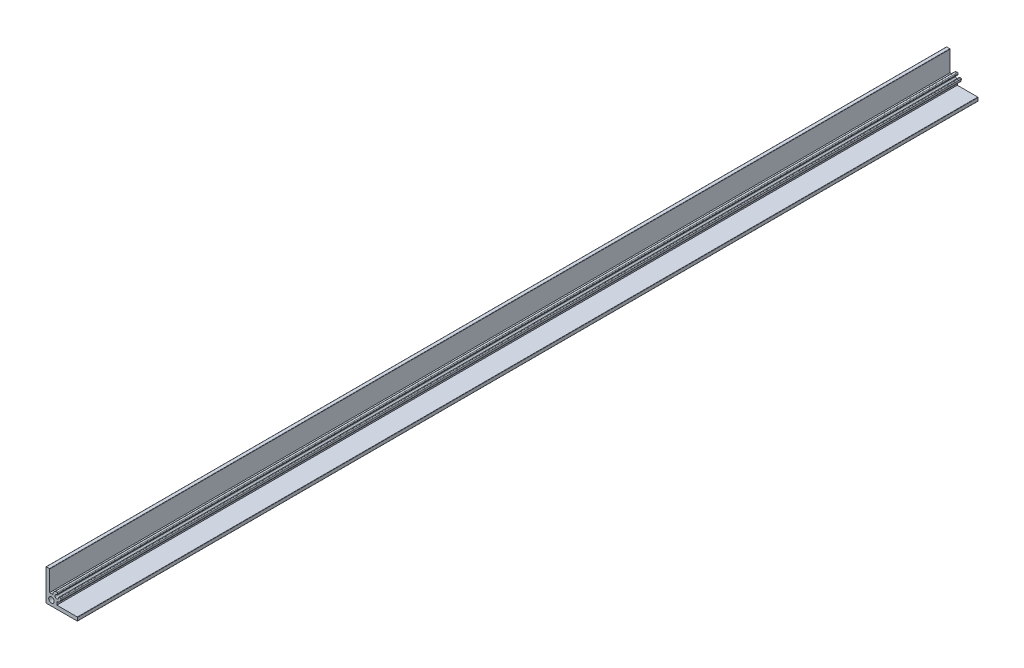
ISO-10303-21;
HEADER;
FILE_DESCRIPTION(('STEP AP214'),'2;1');
FILE_NAME('part.step','',(''),(''),'','','');
FILE_SCHEMA(('AUTOMOTIVE_DESIGN { 1 0 10303 214 1 1 1 1 }'));
ENDSEC;
DATA;
#1=APPLICATION_CONTEXT('core data for automotive mechanical design processes');
#2=APPLICATION_PROTOCOL_DEFINITION('international standard','automotive_design',2000,#1);
#3=PRODUCT_CONTEXT('',#1,'mechanical');
#4=PRODUCT('Part','Part','',(#3));
#5=PRODUCT_RELATED_PRODUCT_CATEGORY('part','',(#4));
#6=PRODUCT_DEFINITION_FORMATION('','',#4);
#7=PRODUCT_DEFINITION_CONTEXT('part definition',#1,'design');
#8=PRODUCT_DEFINITION('design','',#6,#7);
#9=PRODUCT_DEFINITION_SHAPE('','',#8);
#10=(LENGTH_UNIT() NAMED_UNIT(*) SI_UNIT(.MILLI.,.METRE.));
#11=(NAMED_UNIT(*) PLANE_ANGLE_UNIT() SI_UNIT($,.RADIAN.));
#12=(NAMED_UNIT(*) SI_UNIT($,.STERADIAN.) SOLID_ANGLE_UNIT());
#13=UNCERTAINTY_MEASURE_WITH_UNIT(LENGTH_MEASURE(1.E-05),#10,'distance_accuracy_value','');
#14=(GEOMETRIC_REPRESENTATION_CONTEXT(3) GLOBAL_UNCERTAINTY_ASSIGNED_CONTEXT((#13)) GLOBAL_UNIT_ASSIGNED_CONTEXT((#10,
#11,#12)) REPRESENTATION_CONTEXT('',''));
#15=CARTESIAN_POINT('',(0.,0.,0.));
#16=DIRECTION('',(0.,0.,1.));
#17=DIRECTION('',(1.,0.,0.));
#18=AXIS2_PLACEMENT_3D('',#15,#16,#17);
#19=CARTESIAN_POINT('',(11.9999999999999,12.,1000.));
#20=DIRECTION('',(0.,0.,1.));
#21=DIRECTION('',(1.,0.,0.));
#22=AXIS2_PLACEMENT_3D('',#19,#20,#21);
#23=PLANE('',#22);
#24=CARTESIAN_POINT('',(11.9999999999999,12.,1000.));
#25=DIRECTION('',(0.,0.,1.));
#26=DIRECTION('',(1.,0.,0.));
#27=AXIS2_PLACEMENT_3D('',#24,#25,#26);
#28=CIRCLE('',#27,4.50000000000001);
#29=CARTESIAN_POINT('',(12.,7.50000000000001,1000.));
#30=VERTEX_POINT('',#29);
#31=CARTESIAN_POINT('',(16.4879412286593,12.329216536795,1000.));
#32=VERTEX_POINT('',#31);
#33=EDGE_CURVE('E209',#30,#32,#28,.T.);
#34=ORIENTED_EDGE('',*,*,#33,.T.);
#35=CARTESIAN_POINT('',(15.7399510238828,12.2743471139958,1000.));
#36=DIRECTION('',(0.,0.,1.));
#37=DIRECTION('',(1.,0.,0.));
#38=AXIS2_PLACEMENT_3D('',#35,#36,#37);
#39=CIRCLE('',#38,0.75);
#40=CARTESIAN_POINT('',(15.5365921475919,12.996250963157,1000.));
#41=VERTEX_POINT('',#40);
#42=EDGE_CURVE('E328',#32,#41,#39,.T.);
#43=ORIENTED_EDGE('',*,*,#42,.T.);
#44=DIRECTION('',(-0.962538465548211,-0.271145168387887,0.));
#45=VECTOR('',#44,1.);
#46=CARTESIAN_POINT('',(16.3314230949669,13.2201532577455,1000.));
#47=LINE('',#46,#45);
#48=CARTESIAN_POINT('',(14.1949254082614,12.6183061152604,1000.));
#49=VERTEX_POINT('',#48);
#50=EDGE_CURVE('E211',#41,#49,#47,.T.);
#51=ORIENTED_EDGE('',*,*,#50,.T.);
#52=CARTESIAN_POINT('',(14.2762689587777,12.329544575596,1000.));
#53=DIRECTION('',(0.,0.,1.));
#54=DIRECTION('',(1.,0.,0.));
#55=AXIS2_PLACEMENT_3D('',#52,#53,#54);
#56=CIRCLE('',#55,0.3);
#57=CARTESIAN_POINT('',(13.9793643119806,12.2865605005182,1000.));
#58=VERTEX_POINT('',#57);
#59=EDGE_CURVE('E288',#49,#58,#56,.T.);
#60=ORIENTED_EDGE('',*,*,#59,.T.);
#61=CARTESIAN_POINT('',(11.9999999999999,12.,1000.));
#62=DIRECTION('',(0.,0.,-1.));
#63=DIRECTION('',(1.,0.,0.));
#64=AXIS2_PLACEMENT_3D('',#61,#62,#63);
#65=CIRCLE('',#64,2.);
#66=CARTESIAN_POINT('',(12.2865605005182,13.9793643119807,1000.));
#67=VERTEX_POINT('',#66);
#68=EDGE_CURVE('E247',#58,#67,#65,.T.);
#69=ORIENTED_EDGE('',*,*,#68,.T.);
#70=CARTESIAN_POINT('',(12.329544575596,14.2762689587778,1000.));
#71=DIRECTION('',(0.,0.,1.));
#72=DIRECTION('',(1.,0.,0.));
#73=AXIS2_PLACEMENT_3D('',#70,#71,#72);
#74=CIRCLE('',#73,0.3);
#75=CARTESIAN_POINT('',(12.6183061152605,14.1949254082614,1000.));
#76=VERTEX_POINT('',#75);
#77=EDGE_CURVE('E286',#67,#76,#74,.T.);
#78=ORIENTED_EDGE('',*,*,#77,.T.);
#79=DIRECTION('',(0.271145168387888,0.962538465548211,0.));
#80=VECTOR('',#79,1.);
#81=CARTESIAN_POINT('',(12.5422903367757,13.9250769310964,1000.));
#82=LINE('',#81,#80);
#83=CARTESIAN_POINT('',(12.996250963157,15.5365921475919,1000.));
#84=VERTEX_POINT('',#83);
#85=EDGE_CURVE('E173',#76,#84,#82,.T.);
#86=ORIENTED_EDGE('',*,*,#85,.T.);
#87=CARTESIAN_POINT('',(12.2743471139958,15.7399510238828,1000.));
#88=DIRECTION('',(0.,0.,1.));
#89=DIRECTION('',(1.,0.,0.));
#90=AXIS2_PLACEMENT_3D('',#87,#88,#89);
#91=CIRCLE('',#90,0.75);
#92=CARTESIAN_POINT('',(12.329216536795,16.4879412286593,1000.));
#93=VERTEX_POINT('',#92);
#94=EDGE_CURVE('E31',#84,#93,#91,.T.);
#95=ORIENTED_EDGE('',*,*,#94,.T.);
#96=CARTESIAN_POINT('',(11.9999999999999,12.,1000.));
#97=DIRECTION('',(0.,0.,1.));
#98=DIRECTION('',(1.,0.,0.));
#99=AXIS2_PLACEMENT_3D('',#96,#97,#98);
#100=CIRCLE('',#99,4.49999999999995);
#101=CARTESIAN_POINT('',(7.49999999999999,12.,1000.));
#102=VERTEX_POINT('',#101);
#103=EDGE_CURVE('E162',#93,#102,#100,.T.);
#104=ORIENTED_EDGE('',*,*,#103,.T.);
#105=DIRECTION('',(-1.,0.,0.));
#106=VECTOR('',#105,1.);
#107=CARTESIAN_POINT('',(7.50000000000001,12.,1000.));
#108=LINE('',#107,#106);
#109=CARTESIAN_POINT('',(4.,12.,1000.));
#110=VERTEX_POINT('',#109);
#111=EDGE_CURVE('E168',#102,#110,#108,.T.);
#112=ORIENTED_EDGE('',*,*,#111,.T.);
#113=DIRECTION('',(0.,1.,0.));
#114=VECTOR('',#113,1.);
#115=CARTESIAN_POINT('',(4.,12.,1000.));
#116=LINE('',#115,#114);
#117=CARTESIAN_POINT('',(4.,34.7,1000.));
#118=VERTEX_POINT('',#117);
#119=EDGE_CURVE('E188',#110,#118,#116,.T.);
#120=ORIENTED_EDGE('',*,*,#119,.T.);
#121=CARTESIAN_POINT('',(3.7,34.7,1000.));
#122=DIRECTION('',(0.,0.,1.));
#123=DIRECTION('',(1.,0.,0.));
#124=AXIS2_PLACEMENT_3D('',#121,#122,#123);
#125=CIRCLE('',#124,0.3);
#126=CARTESIAN_POINT('',(3.7,35.,1000.));
#127=VERTEX_POINT('',#126);
#128=EDGE_CURVE('E282',#118,#127,#125,.T.);
#129=ORIENTED_EDGE('',*,*,#128,.T.);
#130=DIRECTION('',(-1.,0.,0.));
#131=VECTOR('',#130,1.);
#132=CARTESIAN_POINT('',(4.,35.,1000.));
#133=LINE('',#132,#131);
#134=CARTESIAN_POINT('',(0.3,35.,1000.));
#135=VERTEX_POINT('',#134);
#136=EDGE_CURVE('E190',#127,#135,#133,.T.);
#137=ORIENTED_EDGE('',*,*,#136,.T.);
#138=CARTESIAN_POINT('',(0.3,34.7,1000.));
#139=DIRECTION('',(0.,0.,1.));
#140=DIRECTION('',(1.,0.,0.));
#141=AXIS2_PLACEMENT_3D('',#138,#139,#140);
#142=CIRCLE('',#141,0.3);
#143=CARTESIAN_POINT('',(0.,34.7,1000.));
#144=VERTEX_POINT('',#143);
#145=EDGE_CURVE('E284',#135,#144,#142,.T.);
#146=ORIENTED_EDGE('',*,*,#145,.T.);
#147=DIRECTION('',(0.,-1.,0.));
#148=VECTOR('',#147,1.);
#149=CARTESIAN_POINT('',(0.,35.,1000.));
#150=LINE('',#149,#148);
#151=CARTESIAN_POINT('',(0.,0.300000000000002,1000.));
#152=VERTEX_POINT('',#151);
#153=EDGE_CURVE('E196',#144,#152,#150,.T.);
#154=ORIENTED_EDGE('',*,*,#153,.T.);
#155=CARTESIAN_POINT('',(0.3,0.3,1000.));
#156=DIRECTION('',(0.,0.,1.));
#157=DIRECTION('',(1.,0.,0.));
#158=AXIS2_PLACEMENT_3D('',#155,#156,#157);
#159=CIRCLE('',#158,0.3);
#160=CARTESIAN_POINT('',(0.3,0.,1000.));
#161=VERTEX_POINT('',#160);
#162=EDGE_CURVE('E276',#152,#161,#159,.T.);
#163=ORIENTED_EDGE('',*,*,#162,.T.);
#164=DIRECTION('',(1.,0.,0.));
#165=VECTOR('',#164,1.);
#166=CARTESIAN_POINT('',(0.,0.,1000.));
#167=LINE('',#166,#165);
#168=CARTESIAN_POINT('',(34.7,0.,1000.));
#169=VERTEX_POINT('',#168);
#170=EDGE_CURVE('E199',#161,#169,#167,.T.);
#171=ORIENTED_EDGE('',*,*,#170,.T.);
#172=CARTESIAN_POINT('',(34.7,0.3,1000.));
#173=DIRECTION('',(0.,0.,1.));
#174=DIRECTION('',(1.,0.,0.));
#175=AXIS2_PLACEMENT_3D('',#172,#173,#174);
#176=CIRCLE('',#175,0.3);
#177=CARTESIAN_POINT('',(35.,0.3,1000.));
#178=VERTEX_POINT('',#177);
#179=EDGE_CURVE('E278',#169,#178,#176,.T.);
#180=ORIENTED_EDGE('',*,*,#179,.T.);
#181=DIRECTION('',(0.,1.,0.));
#182=VECTOR('',#181,1.);
#183=CARTESIAN_POINT('',(35.,0.,1000.));
#184=LINE('',#183,#182);
#185=CARTESIAN_POINT('',(35.,3.7,1000.));
#186=VERTEX_POINT('',#185);
#187=EDGE_CURVE('E202',#178,#186,#184,.T.);
#188=ORIENTED_EDGE('',*,*,#187,.T.);
#189=CARTESIAN_POINT('',(34.7,3.7,1000.));
#190=DIRECTION('',(0.,0.,1.));
#191=DIRECTION('',(1.,0.,0.));
#192=AXIS2_PLACEMENT_3D('',#189,#190,#191);
#193=CIRCLE('',#192,0.3);
#194=CARTESIAN_POINT('',(34.7,4.,1000.));
#195=VERTEX_POINT('',#194);
#196=EDGE_CURVE('E280',#186,#195,#193,.T.);
#197=ORIENTED_EDGE('',*,*,#196,.T.);
#198=DIRECTION('',(-1.,0.,0.));
#199=VECTOR('',#198,1.);
#200=CARTESIAN_POINT('',(35.,4.,1000.));
#201=LINE('',#200,#199);
#202=CARTESIAN_POINT('',(12.,4.,1000.));
#203=VERTEX_POINT('',#202);
#204=EDGE_CURVE('E205',#195,#203,#201,.T.);
#205=ORIENTED_EDGE('',*,*,#204,.T.);
#206=DIRECTION('',(0.,1.,0.));
#207=VECTOR('',#206,1.);
#208=CARTESIAN_POINT('',(12.,4.,1000.));
#209=LINE('',#208,#207);
#210=EDGE_CURVE('E207',#203,#30,#209,.T.);
#211=ORIENTED_EDGE('',*,*,#210,.T.);
#212=EDGE_LOOP('',(#34,#43,#51,#60,#69,#78,#86,#95,#104,#112,#120,#129,#137,#146,#154,#163,#171,
#180,#188,#197,#205,#211));
#213=FACE_BOUND('',#212,.T.);
#214=CARTESIAN_POINT('',(5.99999999999994,5.99999999999997,1000.));
#215=DIRECTION('',(0.,0.,1.));
#216=DIRECTION('',(1.,0.,0.));
#217=AXIS2_PLACEMENT_3D('',#214,#215,#216);
#218=CIRCLE('',#217,3.);
#219=CARTESIAN_POINT('',(8.99999999999994,5.99999999999997,1000.));
#220=VERTEX_POINT('',#219);
#221=EDGE_CURVE('E218',#220,#220,#218,.T.);
#222=ORIENTED_EDGE('',*,*,#221,.F.);
#223=EDGE_LOOP('',(#222));
#224=FACE_BOUND('',#223,.T.);
#225=ADVANCED_FACE('F16',(#213,#224),#23,.T.);
#226=CARTESIAN_POINT('',(11.9999999999999,12.,0.));
#227=DIRECTION('',(0.,0.,1.));
#228=DIRECTION('',(1.,0.,0.));
#229=AXIS2_PLACEMENT_3D('',#226,#227,#228);
#230=PLANE('',#229);
#231=DIRECTION('',(-0.962538465548211,-0.271145168387887,0.));
#232=VECTOR('',#231,1.);
#233=CARTESIAN_POINT('',(16.3314230949669,13.2201532577455,0.));
#234=LINE('',#233,#232);
#235=CARTESIAN_POINT('',(15.5365921475919,12.996250963157,0.));
#236=VERTEX_POINT('',#235);
#237=CARTESIAN_POINT('',(14.1949254082614,12.6183061152604,0.));
#238=VERTEX_POINT('',#237);
#239=EDGE_CURVE('E245',#236,#238,#234,.T.);
#240=ORIENTED_EDGE('',*,*,#239,.F.);
#241=CARTESIAN_POINT('',(15.7399510238828,12.2743471139958,0.));
#242=DIRECTION('',(0.,0.,1.));
#243=DIRECTION('',(1.,0.,0.));
#244=AXIS2_PLACEMENT_3D('',#241,#242,#243);
#245=CIRCLE('',#244,0.75);
#246=CARTESIAN_POINT('',(16.4879412286593,12.329216536795,0.));
#247=VERTEX_POINT('',#246);
#248=EDGE_CURVE('E323',#236,#247,#245,.F.);
#249=ORIENTED_EDGE('',*,*,#248,.T.);
#250=CARTESIAN_POINT('',(11.9999999999999,12.,0.));
#251=DIRECTION('',(0.,0.,1.));
#252=DIRECTION('',(1.,0.,0.));
#253=AXIS2_PLACEMENT_3D('',#250,#251,#252);
#254=CIRCLE('',#253,4.50000000000001);
#255=CARTESIAN_POINT('',(12.,7.50000000000001,0.));
#256=VERTEX_POINT('',#255);
#257=EDGE_CURVE('E242',#256,#247,#254,.T.);
#258=ORIENTED_EDGE('',*,*,#257,.F.);
#259=DIRECTION('',(0.,1.,0.));
#260=VECTOR('',#259,1.);
#261=CARTESIAN_POINT('',(12.,4.,0.));
#262=LINE('',#261,#260);
#263=CARTESIAN_POINT('',(12.,4.,0.));
#264=VERTEX_POINT('',#263);
#265=EDGE_CURVE('E240',#264,#256,#262,.T.);
#266=ORIENTED_EDGE('',*,*,#265,.F.);
#267=DIRECTION('',(-1.,0.,0.));
#268=VECTOR('',#267,1.);
#269=CARTESIAN_POINT('',(35.,4.,0.));
#270=LINE('',#269,#268);
#271=CARTESIAN_POINT('',(34.7,4.,0.));
#272=VERTEX_POINT('',#271);
#273=EDGE_CURVE('E238',#272,#264,#270,.T.);
#274=ORIENTED_EDGE('',*,*,#273,.F.);
#275=CARTESIAN_POINT('',(34.7,3.7,0.));
#276=DIRECTION('',(0.,0.,1.));
#277=DIRECTION('',(1.,0.,0.));
#278=AXIS2_PLACEMENT_3D('',#275,#276,#277);
#279=CIRCLE('',#278,0.3);
#280=CARTESIAN_POINT('',(35.,3.7,0.));
#281=VERTEX_POINT('',#280);
#282=EDGE_CURVE('E262',#272,#281,#279,.F.);
#283=ORIENTED_EDGE('',*,*,#282,.T.);
#284=DIRECTION('',(0.,1.,0.));
#285=VECTOR('',#284,1.);
#286=CARTESIAN_POINT('',(35.,0.,0.));
#287=LINE('',#286,#285);
#288=CARTESIAN_POINT('',(35.,0.3,0.));
#289=VERTEX_POINT('',#288);
#290=EDGE_CURVE('E235',#289,#281,#287,.T.);
#291=ORIENTED_EDGE('',*,*,#290,.F.);
#292=CARTESIAN_POINT('',(34.7,0.3,0.));
#293=DIRECTION('',(0.,0.,1.));
#294=DIRECTION('',(1.,0.,0.));
#295=AXIS2_PLACEMENT_3D('',#292,#293,#294);
#296=CIRCLE('',#295,0.3);
#297=CARTESIAN_POINT('',(34.7,0.,0.));
#298=VERTEX_POINT('',#297);
#299=EDGE_CURVE('E260',#289,#298,#296,.F.);
#300=ORIENTED_EDGE('',*,*,#299,.T.);
#301=DIRECTION('',(1.,0.,0.));
#302=VECTOR('',#301,1.);
#303=CARTESIAN_POINT('',(0.,0.,0.));
#304=LINE('',#303,#302);
#305=CARTESIAN_POINT('',(0.3,0.,0.));
#306=VERTEX_POINT('',#305);
#307=EDGE_CURVE('E232',#306,#298,#304,.T.);
#308=ORIENTED_EDGE('',*,*,#307,.F.);
#309=CARTESIAN_POINT('',(0.3,0.3,0.));
#310=DIRECTION('',(0.,0.,1.));
#311=DIRECTION('',(1.,0.,0.));
#312=AXIS2_PLACEMENT_3D('',#309,#310,#311);
#313=CIRCLE('',#312,0.3);
#314=CARTESIAN_POINT('',(0.,0.300000000000002,0.));
#315=VERTEX_POINT('',#314);
#316=EDGE_CURVE('E258',#306,#315,#313,.F.);
#317=ORIENTED_EDGE('',*,*,#316,.T.);
#318=DIRECTION('',(0.,-1.,0.));
#319=VECTOR('',#318,1.);
#320=CARTESIAN_POINT('',(0.,35.,0.));
#321=LINE('',#320,#319);
#322=CARTESIAN_POINT('',(0.,34.7,0.));
#323=VERTEX_POINT('',#322);
#324=EDGE_CURVE('E229',#323,#315,#321,.T.);
#325=ORIENTED_EDGE('',*,*,#324,.F.);
#326=CARTESIAN_POINT('',(0.3,34.7,0.));
#327=DIRECTION('',(0.,0.,1.));
#328=DIRECTION('',(1.,0.,0.));
#329=AXIS2_PLACEMENT_3D('',#326,#327,#328);
#330=CIRCLE('',#329,0.3);
#331=CARTESIAN_POINT('',(0.3,35.,0.));
#332=VERTEX_POINT('',#331);
#333=EDGE_CURVE('E266',#323,#332,#330,.F.);
#334=ORIENTED_EDGE('',*,*,#333,.T.);
#335=DIRECTION('',(-1.,0.,0.));
#336=VECTOR('',#335,1.);
#337=CARTESIAN_POINT('',(4.,35.,0.));
#338=LINE('',#337,#336);
#339=CARTESIAN_POINT('',(3.7,35.,0.));
#340=VERTEX_POINT('',#339);
#341=EDGE_CURVE('E226',#340,#332,#338,.T.);
#342=ORIENTED_EDGE('',*,*,#341,.F.);
#343=CARTESIAN_POINT('',(3.7,34.7,0.));
#344=DIRECTION('',(0.,0.,1.));
#345=DIRECTION('',(1.,0.,0.));
#346=AXIS2_PLACEMENT_3D('',#343,#344,#345);
#347=CIRCLE('',#346,0.3);
#348=CARTESIAN_POINT('',(4.,34.7,0.));
#349=VERTEX_POINT('',#348);
#350=EDGE_CURVE('E264',#340,#349,#347,.F.);
#351=ORIENTED_EDGE('',*,*,#350,.T.);
#352=DIRECTION('',(0.,1.,0.));
#353=VECTOR('',#352,1.);
#354=CARTESIAN_POINT('',(4.,12.,0.));
#355=LINE('',#354,#353);
#356=CARTESIAN_POINT('',(4.,12.,0.));
#357=VERTEX_POINT('',#356);
#358=EDGE_CURVE('E223',#357,#349,#355,.T.);
#359=ORIENTED_EDGE('',*,*,#358,.F.);
#360=DIRECTION('',(-1.,0.,0.));
#361=VECTOR('',#360,1.);
#362=CARTESIAN_POINT('',(7.50000000000001,12.,0.));
#363=LINE('',#362,#361);
#364=CARTESIAN_POINT('',(7.49999999999999,12.,0.));
#365=VERTEX_POINT('',#364);
#366=EDGE_CURVE('E221',#365,#357,#363,.T.);
#367=ORIENTED_EDGE('',*,*,#366,.F.);
#368=CARTESIAN_POINT('',(11.9999999999999,12.,0.));
#369=DIRECTION('',(0.,0.,1.));
#370=DIRECTION('',(1.,0.,0.));
#371=AXIS2_PLACEMENT_3D('',#368,#369,#370);
#372=CIRCLE('',#371,4.49999999999995);
#373=CARTESIAN_POINT('',(12.329216536795,16.4879412286593,0.));
#374=VERTEX_POINT('',#373);
#375=EDGE_CURVE('E179',#374,#365,#372,.T.);
#376=ORIENTED_EDGE('',*,*,#375,.F.);
#377=CARTESIAN_POINT('',(12.2743471139958,15.7399510238828,0.));
#378=DIRECTION('',(0.,0.,1.));
#379=DIRECTION('',(1.,0.,0.));
#380=AXIS2_PLACEMENT_3D('',#377,#378,#379);
#381=CIRCLE('',#380,0.75);
#382=CARTESIAN_POINT('',(12.996250963157,15.5365921475919,0.));
#383=VERTEX_POINT('',#382);
#384=EDGE_CURVE('E321',#374,#383,#381,.F.);
#385=ORIENTED_EDGE('',*,*,#384,.T.);
#386=DIRECTION('',(0.271145168387888,0.962538465548211,0.));
#387=VECTOR('',#386,1.);
#388=CARTESIAN_POINT('',(12.5422903367757,13.9250769310964,0.));
#389=LINE('',#388,#387);
#390=CARTESIAN_POINT('',(12.6183061152605,14.1949254082614,0.));
#391=VERTEX_POINT('',#390);
#392=EDGE_CURVE('E217',#391,#383,#389,.T.);
#393=ORIENTED_EDGE('',*,*,#392,.F.);
#394=CARTESIAN_POINT('',(12.329544575596,14.2762689587778,0.));
#395=DIRECTION('',(0.,0.,1.));
#396=DIRECTION('',(1.,0.,0.));
#397=AXIS2_PLACEMENT_3D('',#394,#395,#396);
#398=CIRCLE('',#397,0.3);
#399=CARTESIAN_POINT('',(12.2865605005182,13.9793643119807,0.));
#400=VERTEX_POINT('',#399);
#401=EDGE_CURVE('E268',#391,#400,#398,.F.);
#402=ORIENTED_EDGE('',*,*,#401,.T.);
#403=CARTESIAN_POINT('',(11.9999999999999,12.,0.));
#404=DIRECTION('',(0.,0.,-1.));
#405=DIRECTION('',(1.,0.,0.));
#406=AXIS2_PLACEMENT_3D('',#403,#404,#405);
#407=CIRCLE('',#406,2.);
#408=CARTESIAN_POINT('',(13.9793643119806,12.2865605005182,0.));
#409=VERTEX_POINT('',#408);
#410=EDGE_CURVE('E214',#409,#400,#407,.T.);
#411=ORIENTED_EDGE('',*,*,#410,.F.);
#412=CARTESIAN_POINT('',(14.2762689587777,12.329544575596,0.));
#413=DIRECTION('',(0.,0.,1.));
#414=DIRECTION('',(1.,0.,0.));
#415=AXIS2_PLACEMENT_3D('',#412,#413,#414);
#416=CIRCLE('',#415,0.3);
#417=EDGE_CURVE('E270',#409,#238,#416,.F.);
#418=ORIENTED_EDGE('',*,*,#417,.T.);
#419=EDGE_LOOP('',(#240,#249,#258,#266,#274,#283,#291,#300,#308,#317,#325,#334,#342,#351,#359,
#367,#376,#385,#393,#402,#411,#418));
#420=FACE_BOUND('',#419,.T.);
#421=CARTESIAN_POINT('',(5.99999999999994,5.99999999999997,0.));
#422=DIRECTION('',(0.,0.,1.));
#423=DIRECTION('',(1.,0.,0.));
#424=AXIS2_PLACEMENT_3D('',#421,#422,#423);
#425=CIRCLE('',#424,3.);
#426=CARTESIAN_POINT('',(8.99999999999994,5.99999999999997,0.));
#427=VERTEX_POINT('',#426);
#428=EDGE_CURVE('E415',#427,#427,#425,.T.);
#429=ORIENTED_EDGE('',*,*,#428,.T.);
#430=EDGE_LOOP('',(#429));
#431=FACE_BOUND('',#430,.T.);
#432=ADVANCED_FACE('F332',(#420,#431),#230,.F.);
#433=CARTESIAN_POINT('',(11.9999999999999,12.,1000.));
#434=DIRECTION('',(0.,0.,-1.));
#435=DIRECTION('',(-1.,0.,0.));
#436=AXIS2_PLACEMENT_3D('',#433,#434,#435);
#437=CYLINDRICAL_SURFACE('',#436,2.);
#438=ORIENTED_EDGE('',*,*,#68,.F.);
#439=DIRECTION('',(0.,0.,-1.));
#440=VECTOR('',#439,1.);
#441=CARTESIAN_POINT('',(13.9793643119806,12.2865605005182,1000.));
#442=LINE('',#441,#440);
#443=EDGE_CURVE('E255',#58,#409,#442,.T.);
#444=ORIENTED_EDGE('',*,*,#443,.T.);
#445=ORIENTED_EDGE('',*,*,#410,.T.);
#446=DIRECTION('',(0.,0.,-1.));
#447=VECTOR('',#446,1.);
#448=CARTESIAN_POINT('',(12.2865605005182,13.9793643119807,1000.));
#449=LINE('',#448,#447);
#450=EDGE_CURVE('E182',#400,#67,#449,.F.);
#451=ORIENTED_EDGE('',*,*,#450,.T.);
#452=EDGE_LOOP('',(#438,#444,#445,#451));
#453=FACE_BOUND('',#452,.T.);
#454=ADVANCED_FACE('F411',(#453),#437,.F.);
#455=CARTESIAN_POINT('',(12.5422903367757,13.9250769310964,1000.));
#456=DIRECTION('',(-0.962538465548211,0.271145168387888,0.));
#457=DIRECTION('',(-0.271145168387888,-0.962538465548211,0.));
#458=AXIS2_PLACEMENT_3D('',#455,#456,#457);
#459=PLANE('',#458);
#460=ORIENTED_EDGE('',*,*,#392,.T.);
#461=DIRECTION('',(0.,0.,-1.));
#462=VECTOR('',#461,1.);
#463=CARTESIAN_POINT('',(12.996250963157,15.5365921475919,1000.));
#464=LINE('',#463,#462);
#465=EDGE_CURVE('E10',#383,#84,#464,.F.);
#466=ORIENTED_EDGE('',*,*,#465,.T.);
#467=ORIENTED_EDGE('',*,*,#85,.F.);
#468=DIRECTION('',(0.,0.,-1.));
#469=VECTOR('',#468,1.);
#470=CARTESIAN_POINT('',(12.6183061152605,14.1949254082614,1000.));
#471=LINE('',#470,#469);
#472=EDGE_CURVE('E290',#76,#391,#471,.T.);
#473=ORIENTED_EDGE('',*,*,#472,.T.);
#474=EDGE_LOOP('',(#460,#466,#467,#473));
#475=FACE_BOUND('',#474,.T.);
#476=ADVANCED_FACE('F454',(#475),#459,.F.);
#477=CARTESIAN_POINT('',(11.9999999999999,12.,1000.));
#478=DIRECTION('',(0.,0.,-1.));
#479=DIRECTION('',(-1.,0.,0.));
#480=AXIS2_PLACEMENT_3D('',#477,#478,#479);
#481=CYLINDRICAL_SURFACE('',#480,4.49999999999995);
#482=ORIENTED_EDGE('',*,*,#103,.F.);
#483=DIRECTION('',(0.,0.,-1.));
#484=VECTOR('',#483,1.);
#485=CARTESIAN_POINT('',(12.329216536795,16.4879412286593,1000.));
#486=LINE('',#485,#484);
#487=EDGE_CURVE('E24',#93,#374,#486,.T.);
#488=ORIENTED_EDGE('',*,*,#487,.T.);
#489=ORIENTED_EDGE('',*,*,#375,.T.);
#490=DIRECTION('',(0.,0.,-1.));
#491=VECTOR('',#490,1.);
#492=CARTESIAN_POINT('',(7.49999999999999,12.,1000.));
#493=LINE('',#492,#491);
#494=EDGE_CURVE('E176',#102,#365,#493,.T.);
#495=ORIENTED_EDGE('',*,*,#494,.F.);
#496=EDGE_LOOP('',(#482,#488,#489,#495));
#497=FACE_BOUND('',#496,.T.);
#498=ADVANCED_FACE('F177',(#497),#481,.T.);
#499=CARTESIAN_POINT('',(7.50000000000001,12.,1000.));
#500=DIRECTION('',(0.,-1.,0.));
#501=DIRECTION('',(1.,0.,0.));
#502=AXIS2_PLACEMENT_3D('',#499,#500,#501);
#503=PLANE('',#502);
#504=ORIENTED_EDGE('',*,*,#366,.T.);
#505=DIRECTION('',(0.,0.,-1.));
#506=VECTOR('',#505,1.);
#507=CARTESIAN_POINT('',(4.,12.,1000.));
#508=LINE('',#507,#506);
#509=EDGE_CURVE('E183',#110,#357,#508,.T.);
#510=ORIENTED_EDGE('',*,*,#509,.F.);
#511=ORIENTED_EDGE('',*,*,#111,.F.);
#512=ORIENTED_EDGE('',*,*,#494,.T.);
#513=EDGE_LOOP('',(#504,#510,#511,#512));
#514=FACE_BOUND('',#513,.T.);
#515=ADVANCED_FACE('F185',(#514),#503,.F.);
#516=CARTESIAN_POINT('',(4.,12.,1000.));
#517=DIRECTION('',(-1.,0.,0.));
#518=DIRECTION('',(0.,0.,1.));
#519=AXIS2_PLACEMENT_3D('',#516,#517,#518);
#520=PLANE('',#519);
#521=ORIENTED_EDGE('',*,*,#358,.T.);
#522=DIRECTION('',(0.,0.,-1.));
#523=VECTOR('',#522,1.);
#524=CARTESIAN_POINT('',(4.,34.7,1000.));
#525=LINE('',#524,#523);
#526=EDGE_CURVE('E303',#349,#118,#525,.F.);
#527=ORIENTED_EDGE('',*,*,#526,.T.);
#528=ORIENTED_EDGE('',*,*,#119,.F.);
#529=ORIENTED_EDGE('',*,*,#509,.T.);
#530=EDGE_LOOP('',(#521,#527,#528,#529));
#531=FACE_BOUND('',#530,.T.);
#532=ADVANCED_FACE('F337',(#531),#520,.F.);
#533=CARTESIAN_POINT('',(4.,35.,1000.));
#534=DIRECTION('',(0.,-1.,0.));
#535=DIRECTION('',(0.,0.,-1.));
#536=AXIS2_PLACEMENT_3D('',#533,#534,#535);
#537=PLANE('',#536);
#538=ORIENTED_EDGE('',*,*,#341,.T.);
#539=DIRECTION('',(0.,0.,-1.));
#540=VECTOR('',#539,1.);
#541=CARTESIAN_POINT('',(0.3,35.,1000.));
#542=LINE('',#541,#540);
#543=EDGE_CURVE('E301',#332,#135,#542,.F.);
#544=ORIENTED_EDGE('',*,*,#543,.T.);
#545=ORIENTED_EDGE('',*,*,#136,.F.);
#546=DIRECTION('',(0.,0.,-1.));
#547=VECTOR('',#546,1.);
#548=CARTESIAN_POINT('',(3.7,35.,1000.));
#549=LINE('',#548,#547);
#550=EDGE_CURVE('E298',#127,#340,#549,.T.);
#551=ORIENTED_EDGE('',*,*,#550,.T.);
#552=EDGE_LOOP('',(#538,#544,#545,#551));
#553=FACE_BOUND('',#552,.T.);
#554=ADVANCED_FACE('F346',(#553),#537,.F.);
#555=CARTESIAN_POINT('',(0.,35.,1000.));
#556=DIRECTION('',(1.,0.,0.));
#557=DIRECTION('',(0.,1.,0.));
#558=AXIS2_PLACEMENT_3D('',#555,#556,#557);
#559=PLANE('',#558);
#560=ORIENTED_EDGE('',*,*,#153,.F.);
#561=DIRECTION('',(0.,0.,-1.));
#562=VECTOR('',#561,1.);
#563=CARTESIAN_POINT('',(0.,34.7,1000.));
#564=LINE('',#563,#562);
#565=EDGE_CURVE('E295',#144,#323,#564,.T.);
#566=ORIENTED_EDGE('',*,*,#565,.T.);
#567=ORIENTED_EDGE('',*,*,#324,.T.);
#568=DIRECTION('',(0.,0.,-1.));
#569=VECTOR('',#568,1.);
#570=CARTESIAN_POINT('',(0.,0.300000000000002,1000.));
#571=LINE('',#570,#569);
#572=EDGE_CURVE('E293',#315,#152,#571,.F.);
#573=ORIENTED_EDGE('',*,*,#572,.T.);
#574=EDGE_LOOP('',(#560,#566,#567,#573));
#575=FACE_BOUND('',#574,.T.);
#576=ADVANCED_FACE('F355',(#575),#559,.F.);
#577=CARTESIAN_POINT('',(0.,0.,1000.));
#578=DIRECTION('',(0.,1.,0.));
#579=DIRECTION('',(0.,0.,1.));
#580=AXIS2_PLACEMENT_3D('',#577,#578,#579);
#581=PLANE('',#580);
#582=ORIENTED_EDGE('',*,*,#307,.T.);
#583=DIRECTION('',(0.,0.,-1.));
#584=VECTOR('',#583,1.);
#585=CARTESIAN_POINT('',(34.7,0.,1000.));
#586=LINE('',#585,#584);
#587=EDGE_CURVE('E316',#298,#169,#586,.F.);
#588=ORIENTED_EDGE('',*,*,#587,.T.);
#589=ORIENTED_EDGE('',*,*,#170,.F.);
#590=DIRECTION('',(0.,0.,-1.));
#591=VECTOR('',#590,1.);
#592=CARTESIAN_POINT('',(0.3,0.,1000.));
#593=LINE('',#592,#591);
#594=EDGE_CURVE('E313',#161,#306,#593,.T.);
#595=ORIENTED_EDGE('',*,*,#594,.T.);
#596=EDGE_LOOP('',(#582,#588,#589,#595));
#597=FACE_BOUND('',#596,.T.);
#598=ADVANCED_FACE('F364',(#597),#581,.F.);
#599=CARTESIAN_POINT('',(35.,0.,1000.));
#600=DIRECTION('',(-1.,0.,0.));
#601=DIRECTION('',(0.,0.,1.));
#602=AXIS2_PLACEMENT_3D('',#599,#600,#601);
#603=PLANE('',#602);
#604=ORIENTED_EDGE('',*,*,#290,.T.);
#605=DIRECTION('',(0.,0.,-1.));
#606=VECTOR('',#605,1.);
#607=CARTESIAN_POINT('',(35.,3.7,1000.));
#608=LINE('',#607,#606);
#609=EDGE_CURVE('E311',#281,#186,#608,.F.);
#610=ORIENTED_EDGE('',*,*,#609,.T.);
#611=ORIENTED_EDGE('',*,*,#187,.F.);
#612=DIRECTION('',(0.,0.,-1.));
#613=VECTOR('',#612,1.);
#614=CARTESIAN_POINT('',(35.,0.3,1000.));
#615=LINE('',#614,#613);
#616=EDGE_CURVE('E308',#178,#289,#615,.T.);
#617=ORIENTED_EDGE('',*,*,#616,.T.);
#618=EDGE_LOOP('',(#604,#610,#611,#617));
#619=FACE_BOUND('',#618,.T.);
#620=ADVANCED_FACE('F373',(#619),#603,.F.);
#621=CARTESIAN_POINT('',(35.,4.,1000.));
#622=DIRECTION('',(0.,-1.,0.));
#623=DIRECTION('',(1.,0.,0.));
#624=AXIS2_PLACEMENT_3D('',#621,#622,#623);
#625=PLANE('',#624);
#626=ORIENTED_EDGE('',*,*,#204,.F.);
#627=DIRECTION('',(0.,0.,-1.));
#628=VECTOR('',#627,1.);
#629=CARTESIAN_POINT('',(34.7,4.,1000.));
#630=LINE('',#629,#628);
#631=EDGE_CURVE('E305',#195,#272,#630,.T.);
#632=ORIENTED_EDGE('',*,*,#631,.T.);
#633=ORIENTED_EDGE('',*,*,#273,.T.);
#634=DIRECTION('',(0.,0.,-1.));
#635=VECTOR('',#634,1.);
#636=CARTESIAN_POINT('',(12.,4.,1000.));
#637=LINE('',#636,#635);
#638=EDGE_CURVE('E250',#203,#264,#637,.T.);
#639=ORIENTED_EDGE('',*,*,#638,.F.);
#640=EDGE_LOOP('',(#626,#632,#633,#639));
#641=FACE_BOUND('',#640,.T.);
#642=ADVANCED_FACE('F382',(#641),#625,.F.);
#643=CARTESIAN_POINT('',(12.,4.,1000.));
#644=DIRECTION('',(-1.,0.,0.));
#645=DIRECTION('',(0.,-1.,0.));
#646=AXIS2_PLACEMENT_3D('',#643,#644,#645);
#647=PLANE('',#646);
#648=ORIENTED_EDGE('',*,*,#265,.T.);
#649=DIRECTION('',(0.,0.,-1.));
#650=VECTOR('',#649,1.);
#651=CARTESIAN_POINT('',(12.,7.50000000000001,1000.));
#652=LINE('',#651,#650);
#653=EDGE_CURVE('E213',#30,#256,#652,.T.);
#654=ORIENTED_EDGE('',*,*,#653,.F.);
#655=ORIENTED_EDGE('',*,*,#210,.F.);
#656=ORIENTED_EDGE('',*,*,#638,.T.);
#657=EDGE_LOOP('',(#648,#654,#655,#656));
#658=FACE_BOUND('',#657,.T.);
#659=ADVANCED_FACE('F388',(#658),#647,.F.);
#660=CARTESIAN_POINT('',(11.9999999999999,12.,1000.));
#661=DIRECTION('',(0.,0.,-1.));
#662=DIRECTION('',(-1.,0.,0.));
#663=AXIS2_PLACEMENT_3D('',#660,#661,#662);
#664=CYLINDRICAL_SURFACE('',#663,4.50000000000001);
#665=ORIENTED_EDGE('',*,*,#257,.T.);
#666=DIRECTION('',(0.,0.,-1.));
#667=VECTOR('',#666,1.);
#668=CARTESIAN_POINT('',(16.4879412286593,12.329216536795,1000.));
#669=LINE('',#668,#667);
#670=EDGE_CURVE('E325',#247,#32,#669,.F.);
#671=ORIENTED_EDGE('',*,*,#670,.T.);
#672=ORIENTED_EDGE('',*,*,#33,.F.);
#673=ORIENTED_EDGE('',*,*,#653,.T.);
#674=EDGE_LOOP('',(#665,#671,#672,#673));
#675=FACE_BOUND('',#674,.T.);
#676=ADVANCED_FACE('F392',(#675),#664,.T.);
#677=CARTESIAN_POINT('',(16.3314230949669,13.2201532577455,1000.));
#678=DIRECTION('',(0.271145168387887,-0.962538465548211,0.));
#679=DIRECTION('',(0.962538465548211,0.271145168387887,0.));
#680=AXIS2_PLACEMENT_3D('',#677,#678,#679);
#681=PLANE('',#680);
#682=ORIENTED_EDGE('',*,*,#50,.F.);
#683=DIRECTION('',(0.,0.,-1.));
#684=VECTOR('',#683,1.);
#685=CARTESIAN_POINT('',(15.5365921475919,12.996250963157,1000.));
#686=LINE('',#685,#684);
#687=EDGE_CURVE('E318',#41,#236,#686,.T.);
#688=ORIENTED_EDGE('',*,*,#687,.T.);
#689=ORIENTED_EDGE('',*,*,#239,.T.);
#690=DIRECTION('',(0.,0.,-1.));
#691=VECTOR('',#690,1.);
#692=CARTESIAN_POINT('',(14.1949254082614,12.6183061152604,1000.));
#693=LINE('',#692,#691);
#694=EDGE_CURVE('E273',#238,#49,#693,.F.);
#695=ORIENTED_EDGE('',*,*,#694,.T.);
#696=EDGE_LOOP('',(#682,#688,#689,#695));
#697=FACE_BOUND('',#696,.T.);
#698=ADVANCED_FACE('F400',(#697),#681,.F.);
#699=CARTESIAN_POINT('',(5.99999999999994,5.99999999999997,1000.));
#700=DIRECTION('',(0.,0.,-1.));
#701=DIRECTION('',(-1.,0.,0.));
#702=AXIS2_PLACEMENT_3D('',#699,#700,#701);
#703=CYLINDRICAL_SURFACE('',#702,3.);
#704=ORIENTED_EDGE('',*,*,#221,.T.);
#705=EDGE_LOOP('',(#704));
#706=FACE_BOUND('',#705,.T.);
#707=ORIENTED_EDGE('',*,*,#428,.F.);
#708=EDGE_LOOP('',(#707));
#709=FACE_BOUND('',#708,.T.);
#710=ADVANCED_FACE('F421',(#706,#709),#703,.F.);
#711=CARTESIAN_POINT('',(14.2762689587777,12.329544575596,1000.));
#712=DIRECTION('',(0.,0.,-1.));
#713=DIRECTION('',(-1.,0.,0.));
#714=AXIS2_PLACEMENT_3D('',#711,#712,#713);
#715=CYLINDRICAL_SURFACE('',#714,0.3);
#716=ORIENTED_EDGE('',*,*,#59,.F.);
#717=ORIENTED_EDGE('',*,*,#694,.F.);
#718=ORIENTED_EDGE('',*,*,#417,.F.);
#719=ORIENTED_EDGE('',*,*,#443,.F.);
#720=EDGE_LOOP('',(#716,#717,#718,#719));
#721=FACE_BOUND('',#720,.T.);
#722=ADVANCED_FACE('F406',(#721),#715,.T.);
#723=CARTESIAN_POINT('',(12.329544575596,14.2762689587778,1000.));
#724=DIRECTION('',(0.,0.,-1.));
#725=DIRECTION('',(-1.,0.,0.));
#726=AXIS2_PLACEMENT_3D('',#723,#724,#725);
#727=CYLINDRICAL_SURFACE('',#726,0.3);
#728=ORIENTED_EDGE('',*,*,#77,.F.);
#729=ORIENTED_EDGE('',*,*,#450,.F.);
#730=ORIENTED_EDGE('',*,*,#401,.F.);
#731=ORIENTED_EDGE('',*,*,#472,.F.);
#732=EDGE_LOOP('',(#728,#729,#730,#731));
#733=FACE_BOUND('',#732,.T.);
#734=ADVANCED_FACE('F461',(#733),#727,.T.);
#735=CARTESIAN_POINT('',(0.3,34.7,1000.));
#736=DIRECTION('',(0.,0.,-1.));
#737=DIRECTION('',(-1.,0.,0.));
#738=AXIS2_PLACEMENT_3D('',#735,#736,#737);
#739=CYLINDRICAL_SURFACE('',#738,0.3);
#740=ORIENTED_EDGE('',*,*,#145,.F.);
#741=ORIENTED_EDGE('',*,*,#543,.F.);
#742=ORIENTED_EDGE('',*,*,#333,.F.);
#743=ORIENTED_EDGE('',*,*,#565,.F.);
#744=EDGE_LOOP('',(#740,#741,#742,#743));
#745=FACE_BOUND('',#744,.T.);
#746=ADVANCED_FACE('F352',(#745),#739,.T.);
#747=CARTESIAN_POINT('',(3.7,34.7,1000.));
#748=DIRECTION('',(0.,0.,-1.));
#749=DIRECTION('',(-1.,0.,0.));
#750=AXIS2_PLACEMENT_3D('',#747,#748,#749);
#751=CYLINDRICAL_SURFACE('',#750,0.3);
#752=ORIENTED_EDGE('',*,*,#128,.F.);
#753=ORIENTED_EDGE('',*,*,#526,.F.);
#754=ORIENTED_EDGE('',*,*,#350,.F.);
#755=ORIENTED_EDGE('',*,*,#550,.F.);
#756=EDGE_LOOP('',(#752,#753,#754,#755));
#757=FACE_BOUND('',#756,.T.);
#758=ADVANCED_FACE('F343',(#757),#751,.T.);
#759=CARTESIAN_POINT('',(34.7,3.7,1000.));
#760=DIRECTION('',(0.,0.,-1.));
#761=DIRECTION('',(-1.,0.,0.));
#762=AXIS2_PLACEMENT_3D('',#759,#760,#761);
#763=CYLINDRICAL_SURFACE('',#762,0.3);
#764=ORIENTED_EDGE('',*,*,#196,.F.);
#765=ORIENTED_EDGE('',*,*,#609,.F.);
#766=ORIENTED_EDGE('',*,*,#282,.F.);
#767=ORIENTED_EDGE('',*,*,#631,.F.);
#768=EDGE_LOOP('',(#764,#765,#766,#767));
#769=FACE_BOUND('',#768,.T.);
#770=ADVANCED_FACE('F379',(#769),#763,.T.);
#771=CARTESIAN_POINT('',(34.7,0.3,1000.));
#772=DIRECTION('',(0.,0.,-1.));
#773=DIRECTION('',(-1.,0.,0.));
#774=AXIS2_PLACEMENT_3D('',#771,#772,#773);
#775=CYLINDRICAL_SURFACE('',#774,0.3);
#776=ORIENTED_EDGE('',*,*,#179,.F.);
#777=ORIENTED_EDGE('',*,*,#587,.F.);
#778=ORIENTED_EDGE('',*,*,#299,.F.);
#779=ORIENTED_EDGE('',*,*,#616,.F.);
#780=EDGE_LOOP('',(#776,#777,#778,#779));
#781=FACE_BOUND('',#780,.T.);
#782=ADVANCED_FACE('F370',(#781),#775,.T.);
#783=CARTESIAN_POINT('',(0.3,0.3,1000.));
#784=DIRECTION('',(0.,0.,-1.));
#785=DIRECTION('',(-1.,0.,0.));
#786=AXIS2_PLACEMENT_3D('',#783,#784,#785);
#787=CYLINDRICAL_SURFACE('',#786,0.3);
#788=ORIENTED_EDGE('',*,*,#162,.F.);
#789=ORIENTED_EDGE('',*,*,#572,.F.);
#790=ORIENTED_EDGE('',*,*,#316,.F.);
#791=ORIENTED_EDGE('',*,*,#594,.F.);
#792=EDGE_LOOP('',(#788,#789,#790,#791));
#793=FACE_BOUND('',#792,.T.);
#794=ADVANCED_FACE('F361',(#793),#787,.T.);
#795=CARTESIAN_POINT('',(15.7399510238828,12.2743471139958,1000.));
#796=DIRECTION('',(0.,0.,-1.));
#797=DIRECTION('',(-1.,0.,0.));
#798=AXIS2_PLACEMENT_3D('',#795,#796,#797);
#799=CYLINDRICAL_SURFACE('',#798,0.75);
#800=ORIENTED_EDGE('',*,*,#42,.F.);
#801=ORIENTED_EDGE('',*,*,#670,.F.);
#802=ORIENTED_EDGE('',*,*,#248,.F.);
#803=ORIENTED_EDGE('',*,*,#687,.F.);
#804=EDGE_LOOP('',(#800,#801,#802,#803));
#805=FACE_BOUND('',#804,.T.);
#806=ADVANCED_FACE('F398',(#805),#799,.T.);
#807=CARTESIAN_POINT('',(12.2743471139958,15.7399510238828,1000.));
#808=DIRECTION('',(0.,0.,-1.));
#809=DIRECTION('',(-1.,0.,0.));
#810=AXIS2_PLACEMENT_3D('',#807,#808,#809);
#811=CYLINDRICAL_SURFACE('',#810,0.75);
#812=ORIENTED_EDGE('',*,*,#94,.F.);
#813=ORIENTED_EDGE('',*,*,#465,.F.);
#814=ORIENTED_EDGE('',*,*,#384,.F.);
#815=ORIENTED_EDGE('',*,*,#487,.F.);
#816=EDGE_LOOP('',(#812,#813,#814,#815));
#817=FACE_BOUND('',#816,.T.);
#818=ADVANCED_FACE('F18',(#817),#811,.T.);
#819=CLOSED_SHELL('',(#225,#432,#454,#476,#498,#515,#532,#554,#576,#598,#620,#642,#659,#676,
#698,#710,#722,#734,#746,#758,#770,#782,#794,#806,#818));
#820=MANIFOLD_SOLID_BREP('B1',#819);
#821=ADVANCED_BREP_SHAPE_REPRESENTATION('',(#18,#820),#14);
#822=SHAPE_DEFINITION_REPRESENTATION(#9,#821);
ENDSEC;
END-ISO-10303-21;
